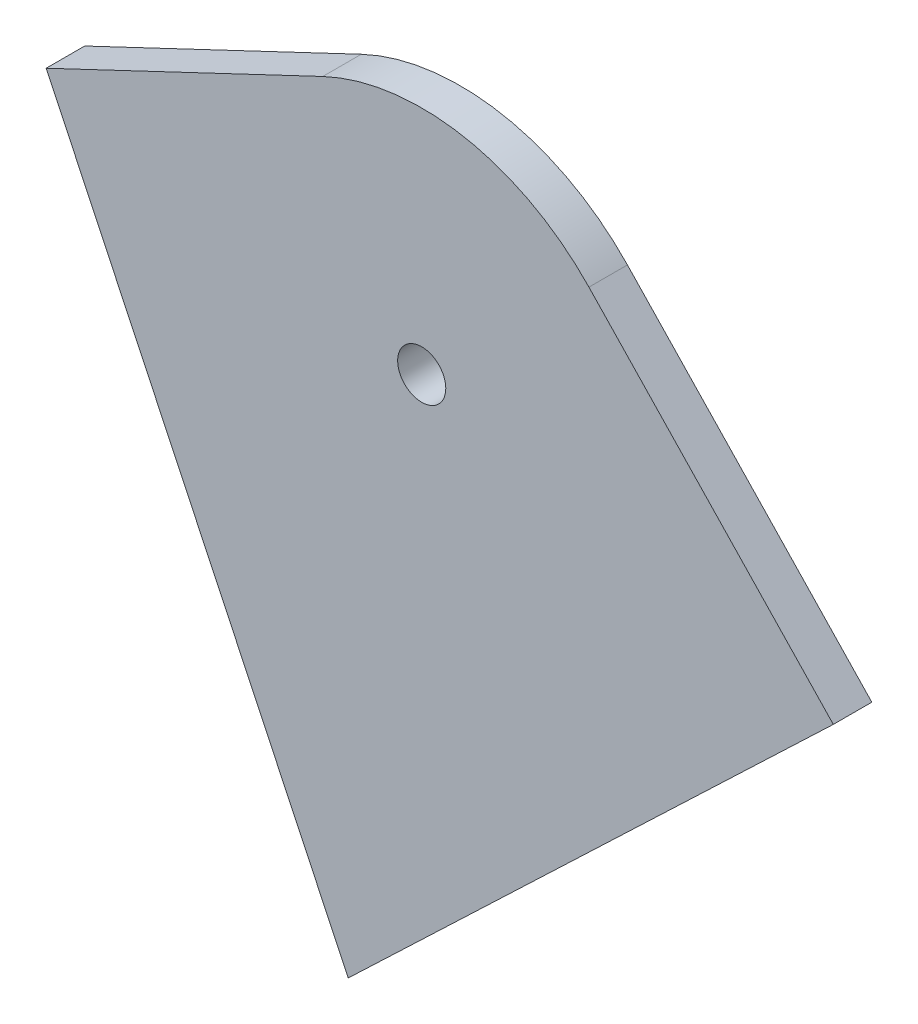
ISO-10303-21;
HEADER;
FILE_DESCRIPTION(('STEP AP214'),'2;1');
FILE_NAME('part.step','',(''),(''),'','','');
FILE_SCHEMA(('AUTOMOTIVE_DESIGN { 1 0 10303 214 1 1 1 1 }'));
ENDSEC;
DATA;
#1=APPLICATION_CONTEXT('core data for automotive mechanical design processes');
#2=APPLICATION_PROTOCOL_DEFINITION('international standard','automotive_design',2000,#1);
#3=PRODUCT_CONTEXT('',#1,'mechanical');
#4=PRODUCT('Part','Part','',(#3));
#5=PRODUCT_RELATED_PRODUCT_CATEGORY('part','',(#4));
#6=PRODUCT_DEFINITION_FORMATION('','',#4);
#7=PRODUCT_DEFINITION_CONTEXT('part definition',#1,'design');
#8=PRODUCT_DEFINITION('design','',#6,#7);
#9=PRODUCT_DEFINITION_SHAPE('','',#8);
#10=(LENGTH_UNIT() NAMED_UNIT(*) SI_UNIT(.MILLI.,.METRE.));
#11=(NAMED_UNIT(*) PLANE_ANGLE_UNIT() SI_UNIT($,.RADIAN.));
#12=(NAMED_UNIT(*) SI_UNIT($,.STERADIAN.) SOLID_ANGLE_UNIT());
#13=UNCERTAINTY_MEASURE_WITH_UNIT(LENGTH_MEASURE(1.E-05),#10,'distance_accuracy_value','');
#14=(GEOMETRIC_REPRESENTATION_CONTEXT(3) GLOBAL_UNCERTAINTY_ASSIGNED_CONTEXT((#13)) GLOBAL_UNIT_ASSIGNED_CONTEXT((#10,
#11,#12)) REPRESENTATION_CONTEXT('',''));
#15=CARTESIAN_POINT('',(0.,0.,0.));
#16=DIRECTION('',(0.,0.,1.));
#17=DIRECTION('',(1.,0.,0.));
#18=AXIS2_PLACEMENT_3D('',#15,#16,#17);
#19=CARTESIAN_POINT('',(-557.229998788497,92.1207338212379,210.82));
#20=DIRECTION('',(0.,0.,1.));
#21=DIRECTION('',(1.,0.,0.));
#22=AXIS2_PLACEMENT_3D('',#19,#20,#21);
#23=PLANE('',#22);
#24=DIRECTION('',(0.724029283384581,0.689769234455706,0.));
#25=VECTOR('',#24,1.);
#26=CARTESIAN_POINT('',(-562.082007515479,55.2071935570609,210.82));
#27=LINE('',#26,#25);
#28=CARTESIAN_POINT('',(-562.082007515479,55.2071935570609,210.82));
#29=VERTEX_POINT('',#28);
#30=CARTESIAN_POINT('',(-530.069182488971,85.7052166592149,210.82));
#31=VERTEX_POINT('',#30);
#32=EDGE_CURVE('E118',#29,#31,#27,.T.);
#33=ORIENTED_EDGE('',*,*,#32,.T.);
#34=DIRECTION('',(-0.689769234455706,0.724029283384581,0.));
#35=VECTOR('',#34,1.);
#36=CARTESIAN_POINT('',(-546.195792509716,102.632816954343,210.82));
#37=LINE('',#36,#35);
#38=CARTESIAN_POINT('',(-546.195792509716,102.632816954343,210.82));
#39=VERTEX_POINT('',#38);
#40=EDGE_CURVE('E85',#31,#39,#37,.T.);
#41=ORIENTED_EDGE('',*,*,#40,.T.);
#42=CARTESIAN_POINT('',(-557.229998788497,92.1207338212379,210.82));
#43=DIRECTION('',(0.,0.,1.));
#44=DIRECTION('',(1.,0.,0.));
#45=AXIS2_PLACEMENT_3D('',#42,#43,#44);
#46=CIRCLE('',#45,15.24);
#47=CARTESIAN_POINT('',(-563.75980662046,105.890962928905,210.82));
#48=VERTEX_POINT('',#47);
#49=EDGE_CURVE('E89',#39,#48,#46,.T.);
#50=ORIENTED_EDGE('',*,*,#49,.T.);
#51=DIRECTION('',(-0.903558340398076,-0.428465080837487,0.));
#52=VECTOR('',#51,1.);
#53=CARTESIAN_POINT('',(-582.011898305763,97.2358671926943,210.82));
#54=LINE('',#53,#52);
#55=CARTESIAN_POINT('',(-582.011898305763,97.2358671926943,210.82));
#56=VERTEX_POINT('',#55);
#57=EDGE_CURVE('E93',#48,#56,#54,.T.);
#58=ORIENTED_EDGE('',*,*,#57,.T.);
#59=DIRECTION('',(0.428465080837487,-0.903558340398076,0.));
#60=VECTOR('',#59,1.);
#61=CARTESIAN_POINT('',(-562.082007515479,55.2071935570609,210.82));
#62=LINE('',#61,#60);
#63=EDGE_CURVE('E51',#56,#29,#62,.T.);
#64=ORIENTED_EDGE('',*,*,#63,.T.);
#65=EDGE_LOOP('',(#33,#41,#50,#58,#64));
#66=FACE_BOUND('',#65,.T.);
#67=CARTESIAN_POINT('',(-557.229998788497,92.1207338212379,210.82));
#68=DIRECTION('',(0.,0.,1.));
#69=DIRECTION('',(1.,0.,0.));
#70=AXIS2_PLACEMENT_3D('',#67,#68,#69);
#71=CIRCLE('',#70,1.58749999999983);
#72=CARTESIAN_POINT('',(-555.642498788497,92.1207338212379,210.82));
#73=VERTEX_POINT('',#72);
#74=EDGE_CURVE('E113',#73,#73,#71,.T.);
#75=ORIENTED_EDGE('',*,*,#74,.F.);
#76=EDGE_LOOP('',(#75));
#77=FACE_BOUND('',#76,.T.);
#78=ADVANCED_FACE('F34',(#66,#77),#23,.T.);
#79=CARTESIAN_POINT('',(-557.229998788497,92.1207338212379,208.28));
#80=DIRECTION('',(0.,0.,1.));
#81=DIRECTION('',(1.,0.,0.));
#82=AXIS2_PLACEMENT_3D('',#79,#80,#81);
#83=PLANE('',#82);
#84=DIRECTION('',(0.724029283384581,0.689769234455706,0.));
#85=VECTOR('',#84,1.);
#86=CARTESIAN_POINT('',(-562.082007515479,55.2071935570609,208.28));
#87=LINE('',#86,#85);
#88=CARTESIAN_POINT('',(-562.082007515479,55.2071935570609,208.28));
#89=VERTEX_POINT('',#88);
#90=CARTESIAN_POINT('',(-530.069182488971,85.7052166592149,208.28));
#91=VERTEX_POINT('',#90);
#92=EDGE_CURVE('E109',#89,#91,#87,.T.);
#93=ORIENTED_EDGE('',*,*,#92,.F.);
#94=DIRECTION('',(0.428465080837487,-0.903558340398076,0.));
#95=VECTOR('',#94,1.);
#96=CARTESIAN_POINT('',(-562.082007515479,55.2071935570609,208.28));
#97=LINE('',#96,#95);
#98=CARTESIAN_POINT('',(-582.011898305763,97.2358671926943,208.28));
#99=VERTEX_POINT('',#98);
#100=EDGE_CURVE('E77',#99,#89,#97,.T.);
#101=ORIENTED_EDGE('',*,*,#100,.F.);
#102=DIRECTION('',(-0.903558340398076,-0.428465080837487,0.));
#103=VECTOR('',#102,1.);
#104=CARTESIAN_POINT('',(-582.011898305763,97.2358671926943,208.28));
#105=LINE('',#104,#103);
#106=CARTESIAN_POINT('',(-563.75980662046,105.890962928905,208.28));
#107=VERTEX_POINT('',#106);
#108=EDGE_CURVE('E71',#107,#99,#105,.T.);
#109=ORIENTED_EDGE('',*,*,#108,.F.);
#110=CARTESIAN_POINT('',(-557.229998788497,92.1207338212379,208.28));
#111=DIRECTION('',(0.,0.,1.));
#112=DIRECTION('',(1.,0.,0.));
#113=AXIS2_PLACEMENT_3D('',#110,#111,#112);
#114=CIRCLE('',#113,15.24);
#115=CARTESIAN_POINT('',(-546.195792509716,102.632816954343,208.28));
#116=VERTEX_POINT('',#115);
#117=EDGE_CURVE('E100',#116,#107,#114,.T.);
#118=ORIENTED_EDGE('',*,*,#117,.F.);
#119=DIRECTION('',(-0.689769234455706,0.724029283384581,0.));
#120=VECTOR('',#119,1.);
#121=CARTESIAN_POINT('',(-546.195792509716,102.632816954343,208.28));
#122=LINE('',#121,#120);
#123=EDGE_CURVE('E112',#91,#116,#122,.T.);
#124=ORIENTED_EDGE('',*,*,#123,.F.);
#125=EDGE_LOOP('',(#93,#101,#109,#118,#124));
#126=FACE_BOUND('',#125,.T.);
#127=CARTESIAN_POINT('',(-557.229998788497,92.1207338212379,208.28));
#128=DIRECTION('',(0.,0.,1.));
#129=DIRECTION('',(1.,0.,0.));
#130=AXIS2_PLACEMENT_3D('',#127,#128,#129);
#131=CIRCLE('',#130,1.58749999999983);
#132=CARTESIAN_POINT('',(-555.642498788497,92.1207338212379,208.28));
#133=VERTEX_POINT('',#132);
#134=EDGE_CURVE('E198',#133,#133,#131,.T.);
#135=ORIENTED_EDGE('',*,*,#134,.T.);
#136=EDGE_LOOP('',(#135));
#137=FACE_BOUND('',#136,.T.);
#138=ADVANCED_FACE('F122',(#126,#137),#83,.F.);
#139=CARTESIAN_POINT('',(-562.082007515479,55.2071935570609,210.82));
#140=DIRECTION('',(-0.689769234455706,0.724029283384581,0.));
#141=DIRECTION('',(-0.724029283384581,-0.689769234455706,0.));
#142=AXIS2_PLACEMENT_3D('',#139,#140,#141);
#143=PLANE('',#142);
#144=ORIENTED_EDGE('',*,*,#92,.T.);
#145=DIRECTION('',(0.,0.,-1.));
#146=VECTOR('',#145,1.);
#147=CARTESIAN_POINT('',(-530.069182488971,85.7052166592149,210.82));
#148=LINE('',#147,#146);
#149=EDGE_CURVE('E11',#31,#91,#148,.T.);
#150=ORIENTED_EDGE('',*,*,#149,.F.);
#151=ORIENTED_EDGE('',*,*,#32,.F.);
#152=DIRECTION('',(0.,0.,-1.));
#153=VECTOR('',#152,1.);
#154=CARTESIAN_POINT('',(-562.082007515479,55.2071935570609,210.82));
#155=LINE('',#154,#153);
#156=EDGE_CURVE('E105',#29,#89,#155,.T.);
#157=ORIENTED_EDGE('',*,*,#156,.T.);
#158=EDGE_LOOP('',(#144,#150,#151,#157));
#159=FACE_BOUND('',#158,.T.);
#160=ADVANCED_FACE('F36',(#159),#143,.F.);
#161=CARTESIAN_POINT('',(-546.195792509716,102.632816954343,210.82));
#162=DIRECTION('',(-0.724029283384581,-0.689769234455706,0.));
#163=DIRECTION('',(0.689769234455706,-0.724029283384581,0.));
#164=AXIS2_PLACEMENT_3D('',#161,#162,#163);
#165=PLANE('',#164);
#166=ORIENTED_EDGE('',*,*,#123,.T.);
#167=DIRECTION('',(0.,0.,-1.));
#168=VECTOR('',#167,1.);
#169=CARTESIAN_POINT('',(-546.195792509716,102.632816954343,210.82));
#170=LINE('',#169,#168);
#171=EDGE_CURVE('E43',#39,#116,#170,.T.);
#172=ORIENTED_EDGE('',*,*,#171,.F.);
#173=ORIENTED_EDGE('',*,*,#40,.F.);
#174=ORIENTED_EDGE('',*,*,#149,.T.);
#175=EDGE_LOOP('',(#166,#172,#173,#174));
#176=FACE_BOUND('',#175,.T.);
#177=ADVANCED_FACE('F147',(#176),#165,.F.);
#178=CARTESIAN_POINT('',(-557.229998788497,92.1207338212379,210.82));
#179=DIRECTION('',(0.,0.,-1.));
#180=DIRECTION('',(-1.,0.,0.));
#181=AXIS2_PLACEMENT_3D('',#178,#179,#180);
#182=CYLINDRICAL_SURFACE('',#181,15.24);
#183=ORIENTED_EDGE('',*,*,#117,.T.);
#184=DIRECTION('',(0.,0.,-1.));
#185=VECTOR('',#184,1.);
#186=CARTESIAN_POINT('',(-563.75980662046,105.890962928905,210.82));
#187=LINE('',#186,#185);
#188=EDGE_CURVE('E97',#48,#107,#187,.T.);
#189=ORIENTED_EDGE('',*,*,#188,.F.);
#190=ORIENTED_EDGE('',*,*,#49,.F.);
#191=ORIENTED_EDGE('',*,*,#171,.T.);
#192=EDGE_LOOP('',(#183,#189,#190,#191));
#193=FACE_BOUND('',#192,.T.);
#194=ADVANCED_FACE('F98',(#193),#182,.T.);
#195=CARTESIAN_POINT('',(-582.011898305763,97.2358671926943,210.82));
#196=DIRECTION('',(0.428465080837487,-0.903558340398076,0.));
#197=DIRECTION('',(0.903558340398076,0.428465080837487,0.));
#198=AXIS2_PLACEMENT_3D('',#195,#196,#197);
#199=PLANE('',#198);
#200=ORIENTED_EDGE('',*,*,#108,.T.);
#201=DIRECTION('',(0.,0.,-1.));
#202=VECTOR('',#201,1.);
#203=CARTESIAN_POINT('',(-582.011898305763,97.2358671926943,210.82));
#204=LINE('',#203,#202);
#205=EDGE_CURVE('E101',#56,#99,#204,.T.);
#206=ORIENTED_EDGE('',*,*,#205,.F.);
#207=ORIENTED_EDGE('',*,*,#57,.F.);
#208=ORIENTED_EDGE('',*,*,#188,.T.);
#209=EDGE_LOOP('',(#200,#206,#207,#208));
#210=FACE_BOUND('',#209,.T.);
#211=ADVANCED_FACE('F103',(#210),#199,.F.);
#212=CARTESIAN_POINT('',(-562.082007515479,55.2071935570609,210.82));
#213=DIRECTION('',(0.903558340398076,0.428465080837487,0.));
#214=DIRECTION('',(-0.428465080837487,0.903558340398076,0.));
#215=AXIS2_PLACEMENT_3D('',#212,#213,#214);
#216=PLANE('',#215);
#217=ORIENTED_EDGE('',*,*,#100,.T.);
#218=ORIENTED_EDGE('',*,*,#156,.F.);
#219=ORIENTED_EDGE('',*,*,#63,.F.);
#220=ORIENTED_EDGE('',*,*,#205,.T.);
#221=EDGE_LOOP('',(#217,#218,#219,#220));
#222=FACE_BOUND('',#221,.T.);
#223=ADVANCED_FACE('F127',(#222),#216,.F.);
#224=CARTESIAN_POINT('',(-557.229998788497,92.1207338212379,210.82));
#225=DIRECTION('',(0.,0.,-1.));
#226=DIRECTION('',(-1.,0.,0.));
#227=AXIS2_PLACEMENT_3D('',#224,#225,#226);
#228=CYLINDRICAL_SURFACE('',#227,1.58749999999983);
#229=ORIENTED_EDGE('',*,*,#74,.T.);
#230=EDGE_LOOP('',(#229));
#231=FACE_BOUND('',#230,.T.);
#232=ORIENTED_EDGE('',*,*,#134,.F.);
#233=EDGE_LOOP('',(#232));
#234=FACE_BOUND('',#233,.T.);
#235=ADVANCED_FACE('F129',(#231,#234),#228,.F.);
#236=CLOSED_SHELL('',(#78,#138,#160,#177,#194,#211,#223,#235));
#237=MANIFOLD_SOLID_BREP('B2',#236);
#238=ADVANCED_BREP_SHAPE_REPRESENTATION('',(#18,#237),#14);
#239=SHAPE_DEFINITION_REPRESENTATION(#9,#238);
ENDSEC;
END-ISO-10303-21;
